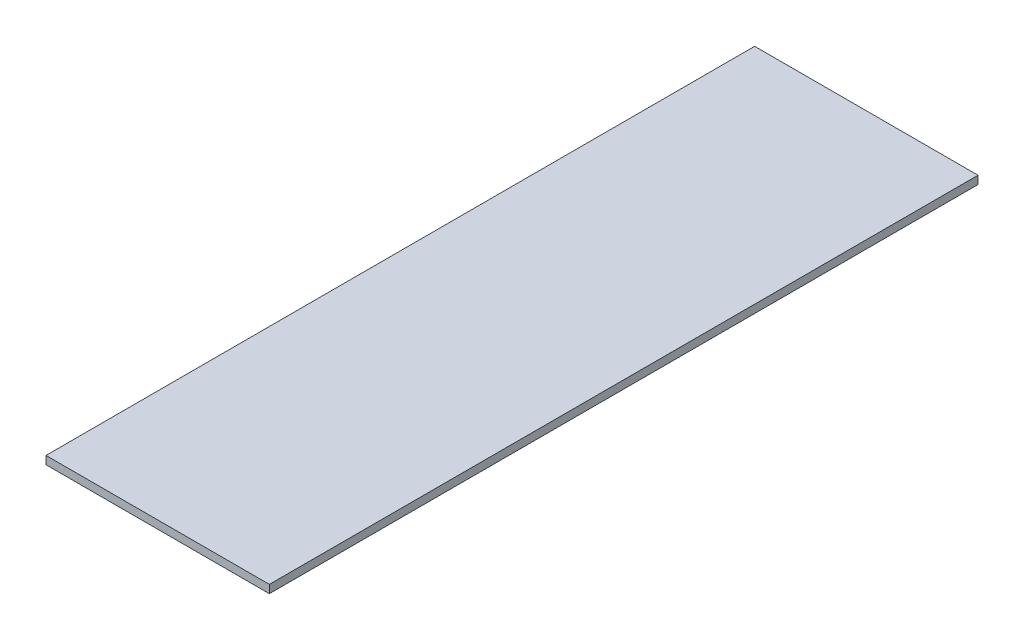
ISO-10303-21;
HEADER;
FILE_DESCRIPTION(('STEP AP214'),'2;1');
FILE_NAME('part.step','',(''),(''),'','','');
FILE_SCHEMA(('AUTOMOTIVE_DESIGN { 1 0 10303 214 1 1 1 1 }'));
ENDSEC;
DATA;
#1=APPLICATION_CONTEXT('core data for automotive mechanical design processes');
#2=APPLICATION_PROTOCOL_DEFINITION('international standard','automotive_design',2000,#1);
#3=PRODUCT_CONTEXT('',#1,'mechanical');
#4=PRODUCT('Part','Part','',(#3));
#5=PRODUCT_RELATED_PRODUCT_CATEGORY('part','',(#4));
#6=PRODUCT_DEFINITION_FORMATION('','',#4);
#7=PRODUCT_DEFINITION_CONTEXT('part definition',#1,'design');
#8=PRODUCT_DEFINITION('design','',#6,#7);
#9=PRODUCT_DEFINITION_SHAPE('','',#8);
#10=(LENGTH_UNIT() NAMED_UNIT(*) SI_UNIT(.MILLI.,.METRE.));
#11=(NAMED_UNIT(*) PLANE_ANGLE_UNIT() SI_UNIT($,.RADIAN.));
#12=(NAMED_UNIT(*) SI_UNIT($,.STERADIAN.) SOLID_ANGLE_UNIT());
#13=UNCERTAINTY_MEASURE_WITH_UNIT(LENGTH_MEASURE(1.E-05),#10,'distance_accuracy_value','');
#14=(GEOMETRIC_REPRESENTATION_CONTEXT(3) GLOBAL_UNCERTAINTY_ASSIGNED_CONTEXT((#13)) GLOBAL_UNIT_ASSIGNED_CONTEXT((#10,
#11,#12)) REPRESENTATION_CONTEXT('',''));
#15=CARTESIAN_POINT('',(0.,0.,0.));
#16=DIRECTION('',(0.,0.,1.));
#17=DIRECTION('',(1.,0.,0.));
#18=AXIS2_PLACEMENT_3D('',#15,#16,#17);
#19=CARTESIAN_POINT('',(-249.,18.,790.));
#20=DIRECTION('',(1.,0.,0.));
#21=DIRECTION('',(0.,0.,-1.));
#22=AXIS2_PLACEMENT_3D('',#19,#20,#21);
#23=PLANE('',#22);
#24=DIRECTION('',(0.,0.,1.));
#25=VECTOR('',#24,1.);
#26=CARTESIAN_POINT('',(-249.,0.,790.));
#27=LINE('',#26,#25);
#28=CARTESIAN_POINT('',(-249.,0.,-790.));
#29=VERTEX_POINT('',#28);
#30=CARTESIAN_POINT('',(-249.,0.,790.));
#31=VERTEX_POINT('',#30);
#32=EDGE_CURVE('E98',#29,#31,#27,.T.);
#33=ORIENTED_EDGE('',*,*,#32,.T.);
#34=DIRECTION('',(0.,-1.,0.));
#35=VECTOR('',#34,1.);
#36=CARTESIAN_POINT('',(-249.,18.,790.));
#37=LINE('',#36,#35);
#38=CARTESIAN_POINT('',(-249.,18.,790.));
#39=VERTEX_POINT('',#38);
#40=EDGE_CURVE('E11',#39,#31,#37,.T.);
#41=ORIENTED_EDGE('',*,*,#40,.F.);
#42=DIRECTION('',(0.,0.,1.));
#43=VECTOR('',#42,1.);
#44=CARTESIAN_POINT('',(-249.,18.,790.));
#45=LINE('',#44,#43);
#46=CARTESIAN_POINT('',(-249.,18.,-790.));
#47=VERTEX_POINT('',#46);
#48=EDGE_CURVE('E86',#47,#39,#45,.T.);
#49=ORIENTED_EDGE('',*,*,#48,.F.);
#50=DIRECTION('',(0.,-1.,0.));
#51=VECTOR('',#50,1.);
#52=CARTESIAN_POINT('',(-249.,18.,-790.));
#53=LINE('',#52,#51);
#54=EDGE_CURVE('E94',#47,#29,#53,.T.);
#55=ORIENTED_EDGE('',*,*,#54,.T.);
#56=EDGE_LOOP('',(#33,#41,#49,#55));
#57=FACE_BOUND('',#56,.T.);
#58=ADVANCED_FACE('F35',(#57),#23,.F.);
#59=CARTESIAN_POINT('',(249.,18.,790.));
#60=DIRECTION('',(0.,0.,-1.));
#61=DIRECTION('',(-1.,0.,0.));
#62=AXIS2_PLACEMENT_3D('',#59,#60,#61);
#63=PLANE('',#62);
#64=DIRECTION('',(1.,0.,0.));
#65=VECTOR('',#64,1.);
#66=CARTESIAN_POINT('',(249.,0.,790.));
#67=LINE('',#66,#65);
#68=CARTESIAN_POINT('',(249.,0.,790.));
#69=VERTEX_POINT('',#68);
#70=EDGE_CURVE('E90',#31,#69,#67,.T.);
#71=ORIENTED_EDGE('',*,*,#70,.T.);
#72=DIRECTION('',(0.,-1.,0.));
#73=VECTOR('',#72,1.);
#74=CARTESIAN_POINT('',(249.,18.,790.));
#75=LINE('',#74,#73);
#76=CARTESIAN_POINT('',(249.,18.,790.));
#77=VERTEX_POINT('',#76);
#78=EDGE_CURVE('E43',#77,#69,#75,.T.);
#79=ORIENTED_EDGE('',*,*,#78,.F.);
#80=DIRECTION('',(1.,0.,0.));
#81=VECTOR('',#80,1.);
#82=CARTESIAN_POINT('',(249.,18.,790.));
#83=LINE('',#82,#81);
#84=EDGE_CURVE('E81',#39,#77,#83,.T.);
#85=ORIENTED_EDGE('',*,*,#84,.F.);
#86=ORIENTED_EDGE('',*,*,#40,.T.);
#87=EDGE_LOOP('',(#71,#79,#85,#86));
#88=FACE_BOUND('',#87,.T.);
#89=ADVANCED_FACE('F89',(#88),#63,.F.);
#90=CARTESIAN_POINT('',(249.,18.,790.));
#91=DIRECTION('',(-1.,0.,0.));
#92=DIRECTION('',(0.,0.,1.));
#93=AXIS2_PLACEMENT_3D('',#90,#91,#92);
#94=PLANE('',#93);
#95=DIRECTION('',(0.,0.,-1.));
#96=VECTOR('',#95,1.);
#97=CARTESIAN_POINT('',(249.,0.,790.));
#98=LINE('',#97,#96);
#99=CARTESIAN_POINT('',(249.,0.,-790.));
#100=VERTEX_POINT('',#99);
#101=EDGE_CURVE('E68',#69,#100,#98,.T.);
#102=ORIENTED_EDGE('',*,*,#101,.T.);
#103=DIRECTION('',(0.,-1.,0.));
#104=VECTOR('',#103,1.);
#105=CARTESIAN_POINT('',(249.,18.,-790.));
#106=LINE('',#105,#104);
#107=CARTESIAN_POINT('',(249.,18.,-790.));
#108=VERTEX_POINT('',#107);
#109=EDGE_CURVE('E91',#108,#100,#106,.T.);
#110=ORIENTED_EDGE('',*,*,#109,.F.);
#111=DIRECTION('',(0.,0.,-1.));
#112=VECTOR('',#111,1.);
#113=CARTESIAN_POINT('',(249.,18.,790.));
#114=LINE('',#113,#112);
#115=EDGE_CURVE('E84',#77,#108,#114,.T.);
#116=ORIENTED_EDGE('',*,*,#115,.F.);
#117=ORIENTED_EDGE('',*,*,#78,.T.);
#118=EDGE_LOOP('',(#102,#110,#116,#117));
#119=FACE_BOUND('',#118,.T.);
#120=ADVANCED_FACE('F92',(#119),#94,.F.);
#121=CARTESIAN_POINT('',(249.,18.,-790.));
#122=DIRECTION('',(0.,0.,1.));
#123=DIRECTION('',(1.,0.,0.));
#124=AXIS2_PLACEMENT_3D('',#121,#122,#123);
#125=PLANE('',#124);
#126=DIRECTION('',(-1.,0.,0.));
#127=VECTOR('',#126,1.);
#128=CARTESIAN_POINT('',(249.,0.,-790.));
#129=LINE('',#128,#127);
#130=EDGE_CURVE('E74',#100,#29,#129,.T.);
#131=ORIENTED_EDGE('',*,*,#130,.T.);
#132=ORIENTED_EDGE('',*,*,#54,.F.);
#133=DIRECTION('',(-1.,0.,0.));
#134=VECTOR('',#133,1.);
#135=CARTESIAN_POINT('',(249.,18.,-790.));
#136=LINE('',#135,#134);
#137=EDGE_CURVE('E51',#108,#47,#136,.T.);
#138=ORIENTED_EDGE('',*,*,#137,.F.);
#139=ORIENTED_EDGE('',*,*,#109,.T.);
#140=EDGE_LOOP('',(#131,#132,#138,#139));
#141=FACE_BOUND('',#140,.T.);
#142=ADVANCED_FACE('F105',(#141),#125,.F.);
#143=CARTESIAN_POINT('',(0.,18.,0.));
#144=DIRECTION('',(0.,1.,0.));
#145=DIRECTION('',(0.,0.,1.));
#146=AXIS2_PLACEMENT_3D('',#143,#144,#145);
#147=PLANE('',#146);
#148=ORIENTED_EDGE('',*,*,#48,.T.);
#149=ORIENTED_EDGE('',*,*,#84,.T.);
#150=ORIENTED_EDGE('',*,*,#115,.T.);
#151=ORIENTED_EDGE('',*,*,#137,.T.);
#152=EDGE_LOOP('',(#148,#149,#150,#151));
#153=FACE_BOUND('',#152,.T.);
#154=ADVANCED_FACE('F82',(#153),#147,.T.);
#155=CARTESIAN_POINT('',(0.,0.,0.));
#156=DIRECTION('',(0.,1.,0.));
#157=DIRECTION('',(0.,0.,1.));
#158=AXIS2_PLACEMENT_3D('',#155,#156,#157);
#159=PLANE('',#158);
#160=ORIENTED_EDGE('',*,*,#32,.F.);
#161=ORIENTED_EDGE('',*,*,#130,.F.);
#162=ORIENTED_EDGE('',*,*,#101,.F.);
#163=ORIENTED_EDGE('',*,*,#70,.F.);
#164=EDGE_LOOP('',(#160,#161,#162,#163));
#165=FACE_BOUND('',#164,.T.);
#166=ADVANCED_FACE('F108',(#165),#159,.F.);
#167=CLOSED_SHELL('',(#58,#89,#120,#142,#154,#166));
#168=MANIFOLD_SOLID_BREP('B2',#167);
#169=ADVANCED_BREP_SHAPE_REPRESENTATION('',(#18,#168),#14);
#170=SHAPE_DEFINITION_REPRESENTATION(#9,#169);
ENDSEC;
END-ISO-10303-21;
